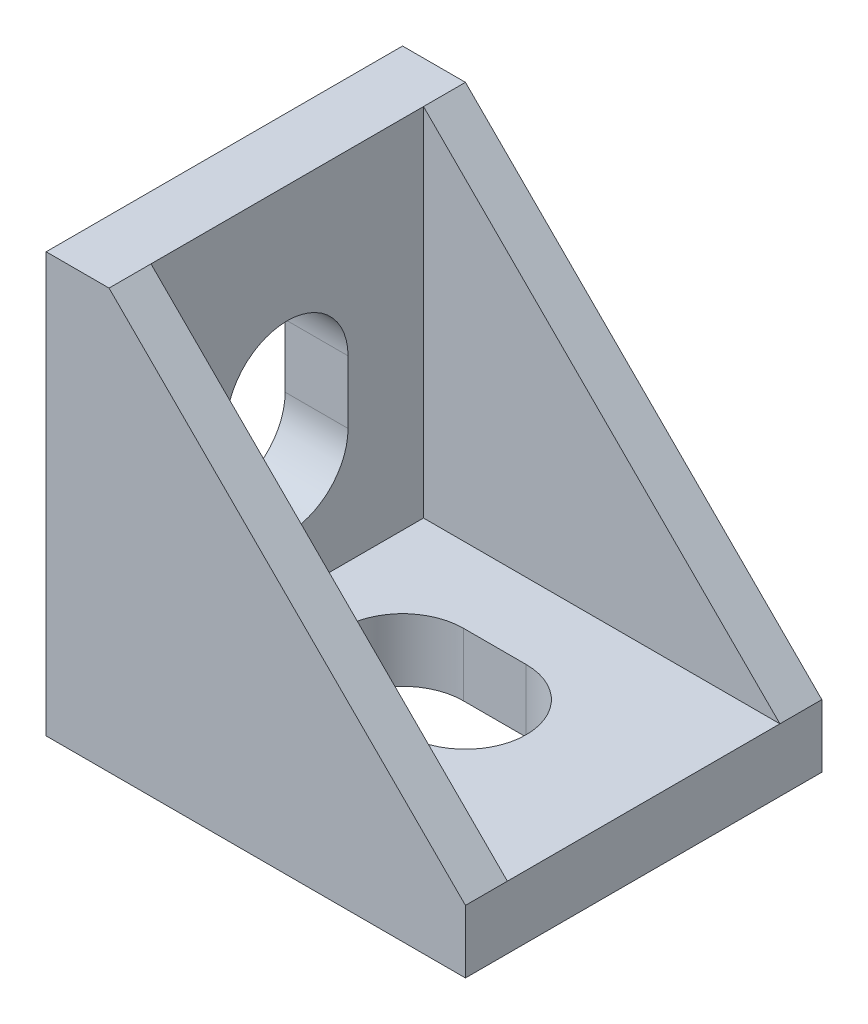
ISO-10303-21;
HEADER;
FILE_DESCRIPTION(('STEP AP214'),'2;1');
FILE_NAME('part.step','',(''),(''),'','','');
FILE_SCHEMA(('AUTOMOTIVE_DESIGN { 1 0 10303 214 1 1 1 1 }'));
ENDSEC;
DATA;
#1=APPLICATION_CONTEXT('core data for automotive mechanical design processes');
#2=APPLICATION_PROTOCOL_DEFINITION('international standard','automotive_design',2000,#1);
#3=PRODUCT_CONTEXT('',#1,'mechanical');
#4=PRODUCT('Part','Part','',(#3));
#5=PRODUCT_RELATED_PRODUCT_CATEGORY('part','',(#4));
#6=PRODUCT_DEFINITION_FORMATION('','',#4);
#7=PRODUCT_DEFINITION_CONTEXT('part definition',#1,'design');
#8=PRODUCT_DEFINITION('design','',#6,#7);
#9=PRODUCT_DEFINITION_SHAPE('','',#8);
#10=(LENGTH_UNIT() NAMED_UNIT(*) SI_UNIT(.MILLI.,.METRE.));
#11=(NAMED_UNIT(*) PLANE_ANGLE_UNIT() SI_UNIT($,.RADIAN.));
#12=(NAMED_UNIT(*) SI_UNIT($,.STERADIAN.) SOLID_ANGLE_UNIT());
#13=UNCERTAINTY_MEASURE_WITH_UNIT(LENGTH_MEASURE(1.E-05),#10,'distance_accuracy_value','');
#14=(GEOMETRIC_REPRESENTATION_CONTEXT(3) GLOBAL_UNCERTAINTY_ASSIGNED_CONTEXT((#13)) GLOBAL_UNIT_ASSIGNED_CONTEXT((#10,
#11,#12)) REPRESENTATION_CONTEXT('',''));
#15=CARTESIAN_POINT('',(0.,0.,0.));
#16=DIRECTION('',(0.,0.,1.));
#17=DIRECTION('',(1.,0.,0.));
#18=AXIS2_PLACEMENT_3D('',#15,#16,#17);
#19=CARTESIAN_POINT('',(0.,0.,-2.));
#20=DIRECTION('',(0.,0.,-1.));
#21=DIRECTION('',(0.,-1.,0.));
#22=AXIS2_PLACEMENT_3D('',#19,#20,#21);
#23=PLANE('',#22);
#24=DIRECTION('',(0.,1.,0.));
#25=VECTOR('',#24,1.);
#26=CARTESIAN_POINT('',(18.5,-0.999999999999928,-2.));
#27=LINE('',#26,#25);
#28=CARTESIAN_POINT('',(18.5,-0.999999999999928,-2.));
#29=VERTEX_POINT('',#28);
#30=CARTESIAN_POINT('',(18.5,0.,-2.));
#31=VERTEX_POINT('',#30);
#32=EDGE_CURVE('E505',#29,#31,#27,.T.);
#33=ORIENTED_EDGE('',*,*,#32,.F.);
#34=DIRECTION('',(1.,0.,0.));
#35=VECTOR('',#34,1.);
#36=CARTESIAN_POINT('',(16.65,-0.999999999999935,-2.));
#37=LINE('',#36,#35);
#38=CARTESIAN_POINT('',(16.65,-0.999999999999935,-2.));
#39=VERTEX_POINT('',#38);
#40=EDGE_CURVE('E25',#39,#29,#37,.T.);
#41=ORIENTED_EDGE('',*,*,#40,.F.);
#42=DIRECTION('',(0.,-1.,0.));
#43=VECTOR('',#42,1.);
#44=CARTESIAN_POINT('',(16.65,0.,-2.));
#45=LINE('',#44,#43);
#46=CARTESIAN_POINT('',(16.65,0.,-2.));
#47=VERTEX_POINT('',#46);
#48=EDGE_CURVE('E598',#47,#39,#45,.T.);
#49=ORIENTED_EDGE('',*,*,#48,.F.);
#50=DIRECTION('',(-1.,0.,0.));
#51=VECTOR('',#50,1.);
#52=CARTESIAN_POINT('',(18.5,0.,-2.));
#53=LINE('',#52,#51);
#54=EDGE_CURVE('E368',#31,#47,#53,.T.);
#55=ORIENTED_EDGE('',*,*,#54,.F.);
#56=EDGE_LOOP('',(#33,#41,#49,#55));
#57=FACE_BOUND('',#56,.T.);
#58=ADVANCED_FACE('F17',(#57),#23,.T.);
#59=CARTESIAN_POINT('',(0.,0.,2.));
#60=DIRECTION('',(0.,0.,-1.));
#61=DIRECTION('',(0.,-1.,0.));
#62=AXIS2_PLACEMENT_3D('',#59,#60,#61);
#63=PLANE('',#62);
#64=DIRECTION('',(0.,1.,0.));
#65=VECTOR('',#64,1.);
#66=CARTESIAN_POINT('',(18.5,-0.999999999999928,2.));
#67=LINE('',#66,#65);
#68=CARTESIAN_POINT('',(18.5,-0.999999999999928,2.));
#69=VERTEX_POINT('',#68);
#70=CARTESIAN_POINT('',(18.5,0.,2.));
#71=VERTEX_POINT('',#70);
#72=EDGE_CURVE('E508',#69,#71,#67,.T.);
#73=ORIENTED_EDGE('',*,*,#72,.T.);
#74=DIRECTION('',(-1.,0.,0.));
#75=VECTOR('',#74,1.);
#76=CARTESIAN_POINT('',(18.5,0.,2.));
#77=LINE('',#76,#75);
#78=CARTESIAN_POINT('',(16.65,0.,2.));
#79=VERTEX_POINT('',#78);
#80=EDGE_CURVE('E316',#71,#79,#77,.T.);
#81=ORIENTED_EDGE('',*,*,#80,.T.);
#82=DIRECTION('',(0.,-1.,0.));
#83=VECTOR('',#82,1.);
#84=CARTESIAN_POINT('',(16.65,0.,2.));
#85=LINE('',#84,#83);
#86=CARTESIAN_POINT('',(16.65,-0.999999999999935,2.));
#87=VERTEX_POINT('',#86);
#88=EDGE_CURVE('E454',#79,#87,#85,.T.);
#89=ORIENTED_EDGE('',*,*,#88,.T.);
#90=DIRECTION('',(1.,0.,0.));
#91=VECTOR('',#90,1.);
#92=CARTESIAN_POINT('',(16.65,-0.999999999999935,2.));
#93=LINE('',#92,#91);
#94=EDGE_CURVE('E11',#87,#69,#93,.T.);
#95=ORIENTED_EDGE('',*,*,#94,.T.);
#96=EDGE_LOOP('',(#73,#81,#89,#95));
#97=FACE_BOUND('',#96,.T.);
#98=ADVANCED_FACE('F673',(#97),#63,.F.);
#99=CARTESIAN_POINT('',(18.5,-0.999999999999928,2.));
#100=DIRECTION('',(0.,1.,0.));
#101=DIRECTION('',(1.,0.,0.));
#102=AXIS2_PLACEMENT_3D('',#99,#100,#101);
#103=PLANE('',#102);
#104=ORIENTED_EDGE('',*,*,#40,.T.);
#105=DIRECTION('',(0.,0.,-1.));
#106=VECTOR('',#105,1.);
#107=CARTESIAN_POINT('',(18.5,-0.999999999999928,2.));
#108=LINE('',#107,#106);
#109=EDGE_CURVE('E594',#69,#29,#108,.T.);
#110=ORIENTED_EDGE('',*,*,#109,.F.);
#111=ORIENTED_EDGE('',*,*,#94,.F.);
#112=DIRECTION('',(0.,0.,-1.));
#113=VECTOR('',#112,1.);
#114=CARTESIAN_POINT('',(16.65,-0.999999999999935,2.));
#115=LINE('',#114,#113);
#116=EDGE_CURVE('E617',#87,#39,#115,.T.);
#117=ORIENTED_EDGE('',*,*,#116,.T.);
#118=EDGE_LOOP('',(#104,#110,#111,#117));
#119=FACE_BOUND('',#118,.T.);
#120=ADVANCED_FACE('F661',(#119),#103,.F.);
#121=CARTESIAN_POINT('',(16.65,0.,2.));
#122=DIRECTION('',(1.,0.,0.));
#123=DIRECTION('',(0.,1.,0.));
#124=AXIS2_PLACEMENT_3D('',#121,#122,#123);
#125=PLANE('',#124);
#126=ORIENTED_EDGE('',*,*,#48,.T.);
#127=ORIENTED_EDGE('',*,*,#116,.F.);
#128=ORIENTED_EDGE('',*,*,#88,.F.);
#129=DIRECTION('',(0.,0.,-1.));
#130=VECTOR('',#129,1.);
#131=CARTESIAN_POINT('',(16.65,0.,2.));
#132=LINE('',#131,#130);
#133=EDGE_CURVE('E377',#79,#47,#132,.T.);
#134=ORIENTED_EDGE('',*,*,#133,.T.);
#135=EDGE_LOOP('',(#126,#127,#128,#134));
#136=FACE_BOUND('',#135,.T.);
#137=ADVANCED_FACE('F663',(#136),#125,.F.);
#138=CARTESIAN_POINT('',(18.5,0.,2.));
#139=DIRECTION('',(-1.,0.,0.));
#140=DIRECTION('',(0.,1.,0.));
#141=AXIS2_PLACEMENT_3D('',#138,#139,#140);
#142=PLANE('',#141);
#143=ORIENTED_EDGE('',*,*,#32,.T.);
#144=DIRECTION('',(0.,0.,-1.));
#145=VECTOR('',#144,1.);
#146=CARTESIAN_POINT('',(18.5,0.,2.));
#147=LINE('',#146,#145);
#148=EDGE_CURVE('E358',#71,#31,#147,.T.);
#149=ORIENTED_EDGE('',*,*,#148,.F.);
#150=ORIENTED_EDGE('',*,*,#72,.F.);
#151=ORIENTED_EDGE('',*,*,#109,.T.);
#152=EDGE_LOOP('',(#143,#149,#150,#151));
#153=FACE_BOUND('',#152,.T.);
#154=ADVANCED_FACE('F671',(#153),#142,.F.);
#155=CARTESIAN_POINT('',(0.,0.,-2.));
#156=DIRECTION('',(0.,0.,-1.));
#157=DIRECTION('',(0.,-1.,0.));
#158=AXIS2_PLACEMENT_3D('',#155,#156,#157);
#159=PLANE('',#158);
#160=DIRECTION('',(-1.,0.,0.));
#161=VECTOR('',#160,1.);
#162=CARTESIAN_POINT('',(3.35,0.,-2.));
#163=LINE('',#162,#161);
#164=CARTESIAN_POINT('',(3.35,0.,-2.));
#165=VERTEX_POINT('',#164);
#166=CARTESIAN_POINT('',(1.5,0.,-2.));
#167=VERTEX_POINT('',#166);
#168=EDGE_CURVE('E352',#165,#167,#163,.T.);
#169=ORIENTED_EDGE('',*,*,#168,.F.);
#170=DIRECTION('',(0.,1.,0.));
#171=VECTOR('',#170,1.);
#172=CARTESIAN_POINT('',(3.35,-0.999999999999984,-2.));
#173=LINE('',#172,#171);
#174=CARTESIAN_POINT('',(3.35,-0.999999999999984,-2.));
#175=VERTEX_POINT('',#174);
#176=EDGE_CURVE('E396',#175,#165,#173,.T.);
#177=ORIENTED_EDGE('',*,*,#176,.F.);
#178=DIRECTION('',(1.,0.,0.));
#179=VECTOR('',#178,1.);
#180=CARTESIAN_POINT('',(1.5,-1.,-2.));
#181=LINE('',#180,#179);
#182=CARTESIAN_POINT('',(1.5,-1.,-2.));
#183=VERTEX_POINT('',#182);
#184=EDGE_CURVE('E401',#183,#175,#181,.T.);
#185=ORIENTED_EDGE('',*,*,#184,.F.);
#186=DIRECTION('',(0.,-1.,0.));
#187=VECTOR('',#186,1.);
#188=CARTESIAN_POINT('',(1.5,0.,-2.));
#189=LINE('',#188,#187);
#190=EDGE_CURVE('E603',#167,#183,#189,.T.);
#191=ORIENTED_EDGE('',*,*,#190,.F.);
#192=EDGE_LOOP('',(#169,#177,#185,#191));
#193=FACE_BOUND('',#192,.T.);
#194=ADVANCED_FACE('F686',(#193),#159,.T.);
#195=CARTESIAN_POINT('',(0.,0.,2.));
#196=DIRECTION('',(0.,0.,-1.));
#197=DIRECTION('',(0.,-1.,0.));
#198=AXIS2_PLACEMENT_3D('',#195,#196,#197);
#199=PLANE('',#198);
#200=DIRECTION('',(-1.,0.,0.));
#201=VECTOR('',#200,1.);
#202=CARTESIAN_POINT('',(3.35,0.,2.));
#203=LINE('',#202,#201);
#204=CARTESIAN_POINT('',(3.35,0.,2.));
#205=VERTEX_POINT('',#204);
#206=CARTESIAN_POINT('',(1.5,0.,2.));
#207=VERTEX_POINT('',#206);
#208=EDGE_CURVE('E378',#205,#207,#203,.T.);
#209=ORIENTED_EDGE('',*,*,#208,.T.);
#210=DIRECTION('',(0.,-1.,0.));
#211=VECTOR('',#210,1.);
#212=CARTESIAN_POINT('',(1.5,0.,2.));
#213=LINE('',#212,#211);
#214=CARTESIAN_POINT('',(1.5,-1.,2.));
#215=VERTEX_POINT('',#214);
#216=EDGE_CURVE('E405',#207,#215,#213,.T.);
#217=ORIENTED_EDGE('',*,*,#216,.T.);
#218=DIRECTION('',(1.,0.,0.));
#219=VECTOR('',#218,1.);
#220=CARTESIAN_POINT('',(1.5,-1.,2.));
#221=LINE('',#220,#219);
#222=CARTESIAN_POINT('',(3.35,-0.999999999999984,2.));
#223=VERTEX_POINT('',#222);
#224=EDGE_CURVE('E392',#215,#223,#221,.T.);
#225=ORIENTED_EDGE('',*,*,#224,.T.);
#226=DIRECTION('',(0.,1.,0.));
#227=VECTOR('',#226,1.);
#228=CARTESIAN_POINT('',(3.35,-0.999999999999984,2.));
#229=LINE('',#228,#227);
#230=EDGE_CURVE('E509',#223,#205,#229,.T.);
#231=ORIENTED_EDGE('',*,*,#230,.T.);
#232=EDGE_LOOP('',(#209,#217,#225,#231));
#233=FACE_BOUND('',#232,.T.);
#234=ADVANCED_FACE('F689',(#233),#199,.F.);
#235=CARTESIAN_POINT('',(3.35,0.,2.));
#236=DIRECTION('',(-1.,0.,0.));
#237=DIRECTION('',(0.,1.,0.));
#238=AXIS2_PLACEMENT_3D('',#235,#236,#237);
#239=PLANE('',#238);
#240=ORIENTED_EDGE('',*,*,#176,.T.);
#241=DIRECTION('',(0.,0.,-1.));
#242=VECTOR('',#241,1.);
#243=CARTESIAN_POINT('',(3.35,0.,2.));
#244=LINE('',#243,#242);
#245=EDGE_CURVE('E382',#205,#165,#244,.T.);
#246=ORIENTED_EDGE('',*,*,#245,.F.);
#247=ORIENTED_EDGE('',*,*,#230,.F.);
#248=DIRECTION('',(0.,0.,-1.));
#249=VECTOR('',#248,1.);
#250=CARTESIAN_POINT('',(3.35,-0.999999999999984,2.));
#251=LINE('',#250,#249);
#252=EDGE_CURVE('E397',#223,#175,#251,.T.);
#253=ORIENTED_EDGE('',*,*,#252,.T.);
#254=EDGE_LOOP('',(#240,#246,#247,#253));
#255=FACE_BOUND('',#254,.T.);
#256=ADVANCED_FACE('F693',(#255),#239,.F.);
#257=CARTESIAN_POINT('',(1.5,-1.,2.));
#258=DIRECTION('',(0.,1.,0.));
#259=DIRECTION('',(1.,0.,0.));
#260=AXIS2_PLACEMENT_3D('',#257,#258,#259);
#261=PLANE('',#260);
#262=ORIENTED_EDGE('',*,*,#184,.T.);
#263=ORIENTED_EDGE('',*,*,#252,.F.);
#264=ORIENTED_EDGE('',*,*,#224,.F.);
#265=DIRECTION('',(0.,0.,-1.));
#266=VECTOR('',#265,1.);
#267=CARTESIAN_POINT('',(1.5,-1.,2.));
#268=LINE('',#267,#266);
#269=EDGE_CURVE('E590',#215,#183,#268,.T.);
#270=ORIENTED_EDGE('',*,*,#269,.T.);
#271=EDGE_LOOP('',(#262,#263,#264,#270));
#272=FACE_BOUND('',#271,.T.);
#273=ADVANCED_FACE('F695',(#272),#261,.F.);
#274=CARTESIAN_POINT('',(1.5,0.,2.));
#275=DIRECTION('',(1.,0.,0.));
#276=DIRECTION('',(0.,-1.,0.));
#277=AXIS2_PLACEMENT_3D('',#274,#275,#276);
#278=PLANE('',#277);
#279=ORIENTED_EDGE('',*,*,#190,.T.);
#280=ORIENTED_EDGE('',*,*,#269,.F.);
#281=ORIENTED_EDGE('',*,*,#216,.F.);
#282=DIRECTION('',(0.,0.,-1.));
#283=VECTOR('',#282,1.);
#284=CARTESIAN_POINT('',(1.5,0.,2.));
#285=LINE('',#284,#283);
#286=EDGE_CURVE('E347',#207,#167,#285,.T.);
#287=ORIENTED_EDGE('',*,*,#286,.T.);
#288=EDGE_LOOP('',(#279,#280,#281,#287));
#289=FACE_BOUND('',#288,.T.);
#290=ADVANCED_FACE('F698',(#289),#278,.F.);
#291=CARTESIAN_POINT('',(0.,0.,-2.));
#292=DIRECTION('',(0.,0.,-1.));
#293=DIRECTION('',(0.,-1.,0.));
#294=AXIS2_PLACEMENT_3D('',#291,#292,#293);
#295=PLANE('',#294);
#296=DIRECTION('',(1.,0.,0.));
#297=VECTOR('',#296,1.);
#298=CARTESIAN_POINT('',(-1.,1.5,-2.));
#299=LINE('',#298,#297);
#300=CARTESIAN_POINT('',(-1.,1.5,-2.));
#301=VERTEX_POINT('',#300);
#302=CARTESIAN_POINT('',(0.,1.5,-2.));
#303=VERTEX_POINT('',#302);
#304=EDGE_CURVE('E346',#301,#303,#299,.T.);
#305=ORIENTED_EDGE('',*,*,#304,.F.);
#306=DIRECTION('',(0.,-1.,0.));
#307=VECTOR('',#306,1.);
#308=CARTESIAN_POINT('',(-1.,3.35,-2.));
#309=LINE('',#308,#307);
#310=CARTESIAN_POINT('',(-1.,3.35,-2.));
#311=VERTEX_POINT('',#310);
#312=EDGE_CURVE('E635',#311,#301,#309,.T.);
#313=ORIENTED_EDGE('',*,*,#312,.F.);
#314=DIRECTION('',(-1.,0.,0.));
#315=VECTOR('',#314,1.);
#316=CARTESIAN_POINT('',(0.,3.35,-2.));
#317=LINE('',#316,#315);
#318=CARTESIAN_POINT('',(0.,3.35,-2.));
#319=VERTEX_POINT('',#318);
#320=EDGE_CURVE('E464',#319,#311,#317,.T.);
#321=ORIENTED_EDGE('',*,*,#320,.F.);
#322=DIRECTION('',(0.,1.,0.));
#323=VECTOR('',#322,1.);
#324=CARTESIAN_POINT('',(0.,1.5,-2.));
#325=LINE('',#324,#323);
#326=EDGE_CURVE('E433',#303,#319,#325,.T.);
#327=ORIENTED_EDGE('',*,*,#326,.F.);
#328=EDGE_LOOP('',(#305,#313,#321,#327));
#329=FACE_BOUND('',#328,.T.);
#330=ADVANCED_FACE('F700',(#329),#295,.T.);
#331=CARTESIAN_POINT('',(0.,0.,2.));
#332=DIRECTION('',(0.,0.,-1.));
#333=DIRECTION('',(0.,-1.,0.));
#334=AXIS2_PLACEMENT_3D('',#331,#332,#333);
#335=PLANE('',#334);
#336=DIRECTION('',(1.,0.,0.));
#337=VECTOR('',#336,1.);
#338=CARTESIAN_POINT('',(-1.,1.5,2.));
#339=LINE('',#338,#337);
#340=CARTESIAN_POINT('',(-1.,1.5,2.));
#341=VERTEX_POINT('',#340);
#342=CARTESIAN_POINT('',(0.,1.5,2.));
#343=VERTEX_POINT('',#342);
#344=EDGE_CURVE('E342',#341,#343,#339,.T.);
#345=ORIENTED_EDGE('',*,*,#344,.T.);
#346=DIRECTION('',(0.,1.,0.));
#347=VECTOR('',#346,1.);
#348=CARTESIAN_POINT('',(0.,1.5,2.));
#349=LINE('',#348,#347);
#350=CARTESIAN_POINT('',(0.,3.35,2.));
#351=VERTEX_POINT('',#350);
#352=EDGE_CURVE('E434',#343,#351,#349,.T.);
#353=ORIENTED_EDGE('',*,*,#352,.T.);
#354=DIRECTION('',(-1.,0.,0.));
#355=VECTOR('',#354,1.);
#356=CARTESIAN_POINT('',(0.,3.35,2.));
#357=LINE('',#356,#355);
#358=CARTESIAN_POINT('',(-1.,3.35,2.));
#359=VERTEX_POINT('',#358);
#360=EDGE_CURVE('E638',#351,#359,#357,.T.);
#361=ORIENTED_EDGE('',*,*,#360,.T.);
#362=DIRECTION('',(0.,-1.,0.));
#363=VECTOR('',#362,1.);
#364=CARTESIAN_POINT('',(-1.,3.35,2.));
#365=LINE('',#364,#363);
#366=EDGE_CURVE('E607',#359,#341,#365,.T.);
#367=ORIENTED_EDGE('',*,*,#366,.T.);
#368=EDGE_LOOP('',(#345,#353,#361,#367));
#369=FACE_BOUND('',#368,.T.);
#370=ADVANCED_FACE('F703',(#369),#335,.F.);
#371=CARTESIAN_POINT('',(-1.,1.5,2.));
#372=DIRECTION('',(1.,0.,0.));
#373=DIRECTION('',(0.,1.,0.));
#374=AXIS2_PLACEMENT_3D('',#371,#372,#373);
#375=PLANE('',#374);
#376=ORIENTED_EDGE('',*,*,#312,.T.);
#377=DIRECTION('',(0.,0.,-1.));
#378=VECTOR('',#377,1.);
#379=CARTESIAN_POINT('',(-1.,1.5,2.));
#380=LINE('',#379,#378);
#381=EDGE_CURVE('E345',#341,#301,#380,.T.);
#382=ORIENTED_EDGE('',*,*,#381,.F.);
#383=ORIENTED_EDGE('',*,*,#366,.F.);
#384=DIRECTION('',(0.,0.,-1.));
#385=VECTOR('',#384,1.);
#386=CARTESIAN_POINT('',(-1.,3.35,2.));
#387=LINE('',#386,#385);
#388=EDGE_CURVE('E634',#359,#311,#387,.T.);
#389=ORIENTED_EDGE('',*,*,#388,.T.);
#390=EDGE_LOOP('',(#376,#382,#383,#389));
#391=FACE_BOUND('',#390,.T.);
#392=ADVANCED_FACE('F707',(#391),#375,.F.);
#393=CARTESIAN_POINT('',(0.,3.35,2.));
#394=DIRECTION('',(0.,-1.,0.));
#395=DIRECTION('',(0.,0.,-1.));
#396=AXIS2_PLACEMENT_3D('',#393,#394,#395);
#397=PLANE('',#396);
#398=ORIENTED_EDGE('',*,*,#320,.T.);
#399=ORIENTED_EDGE('',*,*,#388,.F.);
#400=ORIENTED_EDGE('',*,*,#360,.F.);
#401=DIRECTION('',(0.,0.,-1.));
#402=VECTOR('',#401,1.);
#403=CARTESIAN_POINT('',(0.,3.35,2.));
#404=LINE('',#403,#402);
#405=EDGE_CURVE('E471',#351,#319,#404,.T.);
#406=ORIENTED_EDGE('',*,*,#405,.T.);
#407=EDGE_LOOP('',(#398,#399,#400,#406));
#408=FACE_BOUND('',#407,.T.);
#409=ADVANCED_FACE('F711',(#408),#397,.F.);
#410=CARTESIAN_POINT('',(0.,1.5,2.));
#411=DIRECTION('',(0.,1.,0.));
#412=DIRECTION('',(1.,0.,0.));
#413=AXIS2_PLACEMENT_3D('',#410,#411,#412);
#414=PLANE('',#413);
#415=ORIENTED_EDGE('',*,*,#304,.T.);
#416=DIRECTION('',(0.,0.,-1.));
#417=VECTOR('',#416,1.);
#418=CARTESIAN_POINT('',(0.,1.5,2.));
#419=LINE('',#418,#417);
#420=EDGE_CURVE('E429',#343,#303,#419,.T.);
#421=ORIENTED_EDGE('',*,*,#420,.F.);
#422=ORIENTED_EDGE('',*,*,#344,.F.);
#423=ORIENTED_EDGE('',*,*,#381,.T.);
#424=EDGE_LOOP('',(#415,#421,#422,#423));
#425=FACE_BOUND('',#424,.T.);
#426=ADVANCED_FACE('F715',(#425),#414,.F.);
#427=CARTESIAN_POINT('',(0.,0.,-2.));
#428=DIRECTION('',(0.,0.,-1.));
#429=DIRECTION('',(0.,-1.,0.));
#430=AXIS2_PLACEMENT_3D('',#427,#428,#429);
#431=PLANE('',#430);
#432=DIRECTION('',(0.,1.,0.));
#433=VECTOR('',#432,1.);
#434=CARTESIAN_POINT('',(0.,16.65,-2.));
#435=LINE('',#434,#433);
#436=CARTESIAN_POINT('',(0.,16.65,-2.));
#437=VERTEX_POINT('',#436);
#438=CARTESIAN_POINT('',(0.,18.5,-2.));
#439=VERTEX_POINT('',#438);
#440=EDGE_CURVE('E443',#437,#439,#435,.T.);
#441=ORIENTED_EDGE('',*,*,#440,.F.);
#442=DIRECTION('',(1.,0.,0.));
#443=VECTOR('',#442,1.);
#444=CARTESIAN_POINT('',(-1.,16.65,-2.));
#445=LINE('',#444,#443);
#446=CARTESIAN_POINT('',(-1.,16.65,-2.));
#447=VERTEX_POINT('',#446);
#448=EDGE_CURVE('E415',#447,#437,#445,.T.);
#449=ORIENTED_EDGE('',*,*,#448,.F.);
#450=DIRECTION('',(0.,-1.,0.));
#451=VECTOR('',#450,1.);
#452=CARTESIAN_POINT('',(-1.,18.5,-2.));
#453=LINE('',#452,#451);
#454=CARTESIAN_POINT('',(-1.,18.5,-2.));
#455=VERTEX_POINT('',#454);
#456=EDGE_CURVE('E476',#455,#447,#453,.T.);
#457=ORIENTED_EDGE('',*,*,#456,.F.);
#458=DIRECTION('',(-1.,0.,0.));
#459=VECTOR('',#458,1.);
#460=CARTESIAN_POINT('',(0.,18.5,-2.));
#461=LINE('',#460,#459);
#462=EDGE_CURVE('E386',#439,#455,#461,.T.);
#463=ORIENTED_EDGE('',*,*,#462,.F.);
#464=EDGE_LOOP('',(#441,#449,#457,#463));
#465=FACE_BOUND('',#464,.T.);
#466=ADVANCED_FACE('F719',(#465),#431,.T.);
#467=CARTESIAN_POINT('',(0.,0.,2.));
#468=DIRECTION('',(0.,0.,-1.));
#469=DIRECTION('',(0.,-1.,0.));
#470=AXIS2_PLACEMENT_3D('',#467,#468,#469);
#471=PLANE('',#470);
#472=DIRECTION('',(0.,1.,0.));
#473=VECTOR('',#472,1.);
#474=CARTESIAN_POINT('',(0.,16.65,2.));
#475=LINE('',#474,#473);
#476=CARTESIAN_POINT('',(0.,16.65,2.));
#477=VERTEX_POINT('',#476);
#478=CARTESIAN_POINT('',(0.,18.5,2.));
#479=VERTEX_POINT('',#478);
#480=EDGE_CURVE('E450',#477,#479,#475,.T.);
#481=ORIENTED_EDGE('',*,*,#480,.T.);
#482=DIRECTION('',(-1.,0.,0.));
#483=VECTOR('',#482,1.);
#484=CARTESIAN_POINT('',(0.,18.5,2.));
#485=LINE('',#484,#483);
#486=CARTESIAN_POINT('',(-1.,18.5,2.));
#487=VERTEX_POINT('',#486);
#488=EDGE_CURVE('E472',#479,#487,#485,.T.);
#489=ORIENTED_EDGE('',*,*,#488,.T.);
#490=DIRECTION('',(0.,-1.,0.));
#491=VECTOR('',#490,1.);
#492=CARTESIAN_POINT('',(-1.,18.5,2.));
#493=LINE('',#492,#491);
#494=CARTESIAN_POINT('',(-1.,16.65,2.));
#495=VERTEX_POINT('',#494);
#496=EDGE_CURVE('E332',#487,#495,#493,.T.);
#497=ORIENTED_EDGE('',*,*,#496,.T.);
#498=DIRECTION('',(1.,0.,0.));
#499=VECTOR('',#498,1.);
#500=CARTESIAN_POINT('',(-1.,16.65,2.));
#501=LINE('',#500,#499);
#502=EDGE_CURVE('E412',#495,#477,#501,.T.);
#503=ORIENTED_EDGE('',*,*,#502,.T.);
#504=EDGE_LOOP('',(#481,#489,#497,#503));
#505=FACE_BOUND('',#504,.T.);
#506=ADVANCED_FACE('F723',(#505),#471,.F.);
#507=CARTESIAN_POINT('',(0.,16.65,2.));
#508=DIRECTION('',(0.,1.,0.));
#509=DIRECTION('',(1.,0.,0.));
#510=AXIS2_PLACEMENT_3D('',#507,#508,#509);
#511=PLANE('',#510);
#512=ORIENTED_EDGE('',*,*,#448,.T.);
#513=DIRECTION('',(0.,0.,-1.));
#514=VECTOR('',#513,1.);
#515=CARTESIAN_POINT('',(0.,16.65,2.));
#516=LINE('',#515,#514);
#517=EDGE_CURVE('E447',#477,#437,#516,.T.);
#518=ORIENTED_EDGE('',*,*,#517,.F.);
#519=ORIENTED_EDGE('',*,*,#502,.F.);
#520=DIRECTION('',(0.,0.,-1.));
#521=VECTOR('',#520,1.);
#522=CARTESIAN_POINT('',(-1.,16.65,2.));
#523=LINE('',#522,#521);
#524=EDGE_CURVE('E627',#495,#447,#523,.T.);
#525=ORIENTED_EDGE('',*,*,#524,.T.);
#526=EDGE_LOOP('',(#512,#518,#519,#525));
#527=FACE_BOUND('',#526,.T.);
#528=ADVANCED_FACE('F727',(#527),#511,.F.);
#529=CARTESIAN_POINT('',(-1.,18.5,2.));
#530=DIRECTION('',(1.,0.,0.));
#531=DIRECTION('',(0.,1.,0.));
#532=AXIS2_PLACEMENT_3D('',#529,#530,#531);
#533=PLANE('',#532);
#534=ORIENTED_EDGE('',*,*,#456,.T.);
#535=ORIENTED_EDGE('',*,*,#524,.F.);
#536=ORIENTED_EDGE('',*,*,#496,.F.);
#537=DIRECTION('',(0.,0.,-1.));
#538=VECTOR('',#537,1.);
#539=CARTESIAN_POINT('',(-1.,18.5,2.));
#540=LINE('',#539,#538);
#541=EDGE_CURVE('E477',#487,#455,#540,.T.);
#542=ORIENTED_EDGE('',*,*,#541,.T.);
#543=EDGE_LOOP('',(#534,#535,#536,#542));
#544=FACE_BOUND('',#543,.T.);
#545=ADVANCED_FACE('F731',(#544),#533,.F.);
#546=CARTESIAN_POINT('',(0.,18.5,2.));
#547=DIRECTION('',(0.,-1.,0.));
#548=DIRECTION('',(-1.,0.,0.));
#549=AXIS2_PLACEMENT_3D('',#546,#547,#548);
#550=PLANE('',#549);
#551=ORIENTED_EDGE('',*,*,#462,.T.);
#552=ORIENTED_EDGE('',*,*,#541,.F.);
#553=ORIENTED_EDGE('',*,*,#488,.F.);
#554=DIRECTION('',(0.,0.,-1.));
#555=VECTOR('',#554,1.);
#556=CARTESIAN_POINT('',(0.,18.5,2.));
#557=LINE('',#556,#555);
#558=EDGE_CURVE('E438',#479,#439,#557,.T.);
#559=ORIENTED_EDGE('',*,*,#558,.T.);
#560=EDGE_LOOP('',(#551,#552,#553,#559));
#561=FACE_BOUND('',#560,.T.);
#562=ADVANCED_FACE('F735',(#561),#550,.F.);
#563=CARTESIAN_POINT('',(11.5,0.,-2.9));
#564=DIRECTION('',(0.,0.,-1.));
#565=DIRECTION('',(-1.,0.,0.));
#566=AXIS2_PLACEMENT_3D('',#563,#564,#565);
#567=PLANE('',#566);
#568=DIRECTION('',(-1.,0.,0.));
#569=VECTOR('',#568,1.);
#570=CARTESIAN_POINT('',(11.5,3.,-2.9));
#571=LINE('',#570,#569);
#572=CARTESIAN_POINT('',(11.5,3.,-2.9));
#573=VERTEX_POINT('',#572);
#574=CARTESIAN_POINT('',(8.5,3.,-2.9));
#575=VERTEX_POINT('',#574);
#576=EDGE_CURVE('E428',#573,#575,#571,.T.);
#577=ORIENTED_EDGE('',*,*,#576,.T.);
#578=DIRECTION('',(0.,1.,0.));
#579=VECTOR('',#578,1.);
#580=CARTESIAN_POINT('',(8.5,0.,-2.9));
#581=LINE('',#580,#579);
#582=CARTESIAN_POINT('',(8.5,0.,-2.9));
#583=VERTEX_POINT('',#582);
#584=EDGE_CURVE('E383',#583,#575,#581,.T.);
#585=ORIENTED_EDGE('',*,*,#584,.F.);
#586=DIRECTION('',(-1.,0.,0.));
#587=VECTOR('',#586,1.);
#588=CARTESIAN_POINT('',(11.5,0.,-2.9));
#589=LINE('',#588,#587);
#590=CARTESIAN_POINT('',(11.5,0.,-2.9));
#591=VERTEX_POINT('',#590);
#592=EDGE_CURVE('E423',#591,#583,#589,.T.);
#593=ORIENTED_EDGE('',*,*,#592,.F.);
#594=DIRECTION('',(0.,1.,0.));
#595=VECTOR('',#594,1.);
#596=CARTESIAN_POINT('',(11.5,0.,-2.9));
#597=LINE('',#596,#595);
#598=EDGE_CURVE('E335',#591,#573,#597,.T.);
#599=ORIENTED_EDGE('',*,*,#598,.T.);
#600=EDGE_LOOP('',(#577,#585,#593,#599));
#601=FACE_BOUND('',#600,.T.);
#602=ADVANCED_FACE('F739',(#601),#567,.F.);
#603=CARTESIAN_POINT('',(8.5,0.,0.));
#604=DIRECTION('',(0.,1.,0.));
#605=DIRECTION('',(-1.,0.,0.));
#606=AXIS2_PLACEMENT_3D('',#603,#604,#605);
#607=CYLINDRICAL_SURFACE('',#606,2.9);
#608=CARTESIAN_POINT('',(8.5,3.,0.));
#609=DIRECTION('',(0.,1.,0.));
#610=DIRECTION('',(-1.,0.,0.));
#611=AXIS2_PLACEMENT_3D('',#608,#609,#610);
#612=CIRCLE('',#611,2.9);
#613=CARTESIAN_POINT('',(8.5,3.,2.9));
#614=VERTEX_POINT('',#613);
#615=EDGE_CURVE('E424',#575,#614,#612,.T.);
#616=ORIENTED_EDGE('',*,*,#615,.T.);
#617=DIRECTION('',(0.,1.,0.));
#618=VECTOR('',#617,1.);
#619=CARTESIAN_POINT('',(8.5,0.,2.9));
#620=LINE('',#619,#618);
#621=CARTESIAN_POINT('',(8.5,0.,2.9));
#622=VERTEX_POINT('',#621);
#623=EDGE_CURVE('E387',#622,#614,#620,.T.);
#624=ORIENTED_EDGE('',*,*,#623,.F.);
#625=CARTESIAN_POINT('',(8.5,0.,0.));
#626=DIRECTION('',(0.,1.,0.));
#627=DIRECTION('',(-1.,0.,0.));
#628=AXIS2_PLACEMENT_3D('',#625,#626,#627);
#629=CIRCLE('',#628,2.9);
#630=EDGE_CURVE('E306',#583,#622,#629,.T.);
#631=ORIENTED_EDGE('',*,*,#630,.F.);
#632=ORIENTED_EDGE('',*,*,#584,.T.);
#633=EDGE_LOOP('',(#616,#624,#631,#632));
#634=FACE_BOUND('',#633,.T.);
#635=ADVANCED_FACE('F743',(#634),#607,.F.);
#636=CARTESIAN_POINT('',(11.5,0.,2.9));
#637=DIRECTION('',(0.,0.,1.));
#638=DIRECTION('',(1.,0.,0.));
#639=AXIS2_PLACEMENT_3D('',#636,#637,#638);
#640=PLANE('',#639);
#641=DIRECTION('',(1.,0.,0.));
#642=VECTOR('',#641,1.);
#643=CARTESIAN_POINT('',(8.5,3.,2.9));
#644=LINE('',#643,#642);
#645=CARTESIAN_POINT('',(11.5,3.,2.9));
#646=VERTEX_POINT('',#645);
#647=EDGE_CURVE('E363',#614,#646,#644,.T.);
#648=ORIENTED_EDGE('',*,*,#647,.T.);
#649=DIRECTION('',(0.,1.,0.));
#650=VECTOR('',#649,1.);
#651=CARTESIAN_POINT('',(11.5,0.,2.9));
#652=LINE('',#651,#650);
#653=CARTESIAN_POINT('',(11.5,0.,2.9));
#654=VERTEX_POINT('',#653);
#655=EDGE_CURVE('E483',#654,#646,#652,.T.);
#656=ORIENTED_EDGE('',*,*,#655,.F.);
#657=DIRECTION('',(1.,0.,0.));
#658=VECTOR('',#657,1.);
#659=CARTESIAN_POINT('',(8.5,0.,2.9));
#660=LINE('',#659,#658);
#661=EDGE_CURVE('E351',#622,#654,#660,.T.);
#662=ORIENTED_EDGE('',*,*,#661,.F.);
#663=ORIENTED_EDGE('',*,*,#623,.T.);
#664=EDGE_LOOP('',(#648,#656,#662,#663));
#665=FACE_BOUND('',#664,.T.);
#666=ADVANCED_FACE('F747',(#665),#640,.F.);
#667=CARTESIAN_POINT('',(11.5,0.,0.));
#668=DIRECTION('',(0.,1.,0.));
#669=DIRECTION('',(1.,0.,0.));
#670=AXIS2_PLACEMENT_3D('',#667,#668,#669);
#671=CYLINDRICAL_SURFACE('',#670,2.9);
#672=CARTESIAN_POINT('',(11.5,3.,0.));
#673=DIRECTION('',(0.,1.,0.));
#674=DIRECTION('',(-1.,0.,0.));
#675=AXIS2_PLACEMENT_3D('',#672,#673,#674);
#676=CIRCLE('',#675,2.9);
#677=EDGE_CURVE('E359',#646,#573,#676,.T.);
#678=ORIENTED_EDGE('',*,*,#677,.T.);
#679=ORIENTED_EDGE('',*,*,#598,.F.);
#680=CARTESIAN_POINT('',(11.5,0.,0.));
#681=DIRECTION('',(0.,1.,0.));
#682=DIRECTION('',(-1.,0.,0.));
#683=AXIS2_PLACEMENT_3D('',#680,#681,#682);
#684=CIRCLE('',#683,2.9);
#685=EDGE_CURVE('E391',#654,#591,#684,.T.);
#686=ORIENTED_EDGE('',*,*,#685,.F.);
#687=ORIENTED_EDGE('',*,*,#655,.T.);
#688=EDGE_LOOP('',(#678,#679,#686,#687));
#689=FACE_BOUND('',#688,.T.);
#690=ADVANCED_FACE('F751',(#689),#671,.F.);
#691=CARTESIAN_POINT('',(-0.00100000000002832,8.5,-2.9));
#692=DIRECTION('',(0.,0.,-1.));
#693=DIRECTION('',(-1.,0.,0.));
#694=AXIS2_PLACEMENT_3D('',#691,#692,#693);
#695=PLANE('',#694);
#696=DIRECTION('',(0.,-1.,0.));
#697=VECTOR('',#696,1.);
#698=CARTESIAN_POINT('',(0.,11.5,-2.9));
#699=LINE('',#698,#697);
#700=CARTESIAN_POINT('',(0.,11.5,-2.9));
#701=VERTEX_POINT('',#700);
#702=CARTESIAN_POINT('',(0.,8.5,-2.9));
#703=VERTEX_POINT('',#702);
#704=EDGE_CURVE('E500',#701,#703,#699,.T.);
#705=ORIENTED_EDGE('',*,*,#704,.T.);
#706=DIRECTION('',(1.,0.,0.));
#707=VECTOR('',#706,1.);
#708=CARTESIAN_POINT('',(0.,8.5,-2.9));
#709=LINE('',#708,#707);
#710=CARTESIAN_POINT('',(3.,8.5,-2.9));
#711=VERTEX_POINT('',#710);
#712=EDGE_CURVE('E416',#703,#711,#709,.T.);
#713=ORIENTED_EDGE('',*,*,#712,.T.);
#714=DIRECTION('',(0.,1.,0.));
#715=VECTOR('',#714,1.);
#716=CARTESIAN_POINT('',(3.,8.5,-2.9));
#717=LINE('',#716,#715);
#718=CARTESIAN_POINT('',(3.,11.5,-2.9));
#719=VERTEX_POINT('',#718);
#720=EDGE_CURVE('E522',#711,#719,#717,.T.);
#721=ORIENTED_EDGE('',*,*,#720,.T.);
#722=DIRECTION('',(1.,0.,0.));
#723=VECTOR('',#722,1.);
#724=CARTESIAN_POINT('',(0.,11.5,-2.9));
#725=LINE('',#724,#723);
#726=EDGE_CURVE('E333',#701,#719,#725,.T.);
#727=ORIENTED_EDGE('',*,*,#726,.F.);
#728=EDGE_LOOP('',(#705,#713,#721,#727));
#729=FACE_BOUND('',#728,.T.);
#730=ADVANCED_FACE('F755',(#729),#695,.F.);
#731=CARTESIAN_POINT('',(-0.00100000000002095,11.5,0.));
#732=DIRECTION('',(1.,0.,0.));
#733=DIRECTION('',(0.,1.,0.));
#734=AXIS2_PLACEMENT_3D('',#731,#732,#733);
#735=CYLINDRICAL_SURFACE('',#734,2.9);
#736=CARTESIAN_POINT('',(0.,11.5,0.));
#737=DIRECTION('',(-1.,0.,0.));
#738=DIRECTION('',(0.,1.,0.));
#739=AXIS2_PLACEMENT_3D('',#736,#737,#738);
#740=CIRCLE('',#739,2.9);
#741=CARTESIAN_POINT('',(0.,11.5,2.9));
#742=VERTEX_POINT('',#741);
#743=EDGE_CURVE('E504',#742,#701,#740,.T.);
#744=ORIENTED_EDGE('',*,*,#743,.T.);
#745=ORIENTED_EDGE('',*,*,#726,.T.);
#746=CARTESIAN_POINT('',(3.,11.5,0.));
#747=DIRECTION('',(1.,0.,0.));
#748=DIRECTION('',(0.,1.,0.));
#749=AXIS2_PLACEMENT_3D('',#746,#747,#748);
#750=CIRCLE('',#749,2.9);
#751=CARTESIAN_POINT('',(3.,11.5,2.9));
#752=VERTEX_POINT('',#751);
#753=EDGE_CURVE('E364',#719,#752,#750,.T.);
#754=ORIENTED_EDGE('',*,*,#753,.T.);
#755=DIRECTION('',(1.,0.,0.));
#756=VECTOR('',#755,1.);
#757=CARTESIAN_POINT('',(0.,11.5,2.9));
#758=LINE('',#757,#756);
#759=EDGE_CURVE('E336',#742,#752,#758,.T.);
#760=ORIENTED_EDGE('',*,*,#759,.F.);
#761=EDGE_LOOP('',(#744,#745,#754,#760));
#762=FACE_BOUND('',#761,.T.);
#763=ADVANCED_FACE('F762',(#762),#735,.F.);
#764=CARTESIAN_POINT('',(-0.00100000000002745,8.5,2.9));
#765=DIRECTION('',(0.,0.,1.));
#766=DIRECTION('',(0.,-1.,0.));
#767=AXIS2_PLACEMENT_3D('',#764,#765,#766);
#768=PLANE('',#767);
#769=DIRECTION('',(0.,1.,0.));
#770=VECTOR('',#769,1.);
#771=CARTESIAN_POINT('',(0.,8.5,2.9));
#772=LINE('',#771,#770);
#773=CARTESIAN_POINT('',(0.,8.5,2.9));
#774=VERTEX_POINT('',#773);
#775=EDGE_CURVE('E442',#774,#742,#772,.T.);
#776=ORIENTED_EDGE('',*,*,#775,.T.);
#777=ORIENTED_EDGE('',*,*,#759,.T.);
#778=DIRECTION('',(0.,-1.,0.));
#779=VECTOR('',#778,1.);
#780=CARTESIAN_POINT('',(3.,11.5,2.9));
#781=LINE('',#780,#779);
#782=CARTESIAN_POINT('',(3.,8.5,2.9));
#783=VERTEX_POINT('',#782);
#784=EDGE_CURVE('E580',#752,#783,#781,.T.);
#785=ORIENTED_EDGE('',*,*,#784,.T.);
#786=DIRECTION('',(1.,0.,0.));
#787=VECTOR('',#786,1.);
#788=CARTESIAN_POINT('',(0.,8.5,2.9));
#789=LINE('',#788,#787);
#790=EDGE_CURVE('E419',#774,#783,#789,.T.);
#791=ORIENTED_EDGE('',*,*,#790,.F.);
#792=EDGE_LOOP('',(#776,#777,#785,#791));
#793=FACE_BOUND('',#792,.T.);
#794=ADVANCED_FACE('F766',(#793),#768,.F.);
#795=CARTESIAN_POINT('',(-0.00100000000002789,8.5,0.));
#796=DIRECTION('',(1.,0.,0.));
#797=DIRECTION('',(0.,-1.,0.));
#798=AXIS2_PLACEMENT_3D('',#795,#796,#797);
#799=CYLINDRICAL_SURFACE('',#798,2.9);
#800=CARTESIAN_POINT('',(0.,8.5,0.));
#801=DIRECTION('',(-1.,0.,0.));
#802=DIRECTION('',(0.,1.,0.));
#803=AXIS2_PLACEMENT_3D('',#800,#801,#802);
#804=CIRCLE('',#803,2.9);
#805=EDGE_CURVE('E496',#703,#774,#804,.T.);
#806=ORIENTED_EDGE('',*,*,#805,.T.);
#807=ORIENTED_EDGE('',*,*,#790,.T.);
#808=CARTESIAN_POINT('',(3.,8.5,0.));
#809=DIRECTION('',(1.,0.,0.));
#810=DIRECTION('',(0.,1.,0.));
#811=AXIS2_PLACEMENT_3D('',#808,#809,#810);
#812=CIRCLE('',#811,2.9);
#813=EDGE_CURVE('E526',#783,#711,#812,.T.);
#814=ORIENTED_EDGE('',*,*,#813,.T.);
#815=ORIENTED_EDGE('',*,*,#712,.F.);
#816=EDGE_LOOP('',(#806,#807,#814,#815));
#817=FACE_BOUND('',#816,.T.);
#818=ADVANCED_FACE('F768',(#817),#799,.F.);
#819=CARTESIAN_POINT('',(0.,3.,0.));
#820=DIRECTION('',(0.,1.,0.));
#821=DIRECTION('',(1.,0.,0.));
#822=AXIS2_PLACEMENT_3D('',#819,#820,#821);
#823=PLANE('',#822);
#824=ORIENTED_EDGE('',*,*,#677,.F.);
#825=ORIENTED_EDGE('',*,*,#647,.F.);
#826=ORIENTED_EDGE('',*,*,#615,.F.);
#827=ORIENTED_EDGE('',*,*,#576,.F.);
#828=EDGE_LOOP('',(#824,#825,#826,#827));
#829=FACE_BOUND('',#828,.T.);
#830=DIRECTION('',(0.,0.,1.));
#831=VECTOR('',#830,1.);
#832=CARTESIAN_POINT('',(2.99999999999996,3.,-6.5));
#833=LINE('',#832,#831);
#834=CARTESIAN_POINT('',(2.99999999999996,3.,-6.5));
#835=VERTEX_POINT('',#834);
#836=CARTESIAN_POINT('',(2.99999999999996,3.,6.5));
#837=VERTEX_POINT('',#836);
#838=EDGE_CURVE('E527',#835,#837,#833,.T.);
#839=ORIENTED_EDGE('',*,*,#838,.T.);
#840=DIRECTION('',(1.,0.,0.));
#841=VECTOR('',#840,1.);
#842=CARTESIAN_POINT('',(2.99999999999996,3.,6.5));
#843=LINE('',#842,#841);
#844=CARTESIAN_POINT('',(20.,2.99999999999995,6.5));
#845=VERTEX_POINT('',#844);
#846=EDGE_CURVE('E369',#837,#845,#843,.T.);
#847=ORIENTED_EDGE('',*,*,#846,.T.);
#848=DIRECTION('',(0.,0.,-1.));
#849=VECTOR('',#848,1.);
#850=CARTESIAN_POINT('',(20.,2.99999999999995,6.5));
#851=LINE('',#850,#849);
#852=CARTESIAN_POINT('',(20.,2.99999999999995,-6.5));
#853=VERTEX_POINT('',#852);
#854=EDGE_CURVE('E534',#845,#853,#851,.T.);
#855=ORIENTED_EDGE('',*,*,#854,.T.);
#856=DIRECTION('',(-1.,0.,0.));
#857=VECTOR('',#856,1.);
#858=CARTESIAN_POINT('',(20.,2.99999999999995,-6.5));
#859=LINE('',#858,#857);
#860=EDGE_CURVE('E373',#853,#835,#859,.T.);
#861=ORIENTED_EDGE('',*,*,#860,.T.);
#862=EDGE_LOOP('',(#839,#847,#855,#861));
#863=FACE_BOUND('',#862,.T.);
#864=ADVANCED_FACE('F771',(#829,#863),#823,.T.);
#865=CARTESIAN_POINT('',(2.99999999999996,3.,-6.5));
#866=DIRECTION('',(-1.,0.,0.));
#867=DIRECTION('',(0.,0.,1.));
#868=AXIS2_PLACEMENT_3D('',#865,#866,#867);
#869=PLANE('',#868);
#870=ORIENTED_EDGE('',*,*,#720,.F.);
#871=ORIENTED_EDGE('',*,*,#813,.F.);
#872=ORIENTED_EDGE('',*,*,#784,.F.);
#873=ORIENTED_EDGE('',*,*,#753,.F.);
#874=EDGE_LOOP('',(#870,#871,#872,#873));
#875=FACE_BOUND('',#874,.T.);
#876=DIRECTION('',(0.,0.,1.));
#877=VECTOR('',#876,1.);
#878=CARTESIAN_POINT('',(3.,20.,-6.5));
#879=LINE('',#878,#877);
#880=CARTESIAN_POINT('',(3.,20.,-6.5));
#881=VERTEX_POINT('',#880);
#882=CARTESIAN_POINT('',(3.,20.,6.5));
#883=VERTEX_POINT('',#882);
#884=EDGE_CURVE('E535',#881,#883,#879,.T.);
#885=ORIENTED_EDGE('',*,*,#884,.T.);
#886=DIRECTION('',(0.,1.,0.));
#887=VECTOR('',#886,1.);
#888=CARTESIAN_POINT('',(2.99999999999996,3.,6.5));
#889=LINE('',#888,#887);
#890=EDGE_CURVE('E372',#837,#883,#889,.T.);
#891=ORIENTED_EDGE('',*,*,#890,.F.);
#892=ORIENTED_EDGE('',*,*,#838,.F.);
#893=DIRECTION('',(0.,1.,0.));
#894=VECTOR('',#893,1.);
#895=CARTESIAN_POINT('',(2.99999999999996,3.,-6.5));
#896=LINE('',#895,#894);
#897=EDGE_CURVE('E339',#835,#881,#896,.T.);
#898=ORIENTED_EDGE('',*,*,#897,.T.);
#899=EDGE_LOOP('',(#885,#891,#892,#898));
#900=FACE_BOUND('',#899,.T.);
#901=ADVANCED_FACE('F778',(#875,#900),#869,.F.);
#902=CARTESIAN_POINT('',(2.99999999999996,3.,6.5));
#903=DIRECTION('',(0.,0.,1.));
#904=DIRECTION('',(1.,0.,0.));
#905=AXIS2_PLACEMENT_3D('',#902,#903,#904);
#906=PLANE('',#905);
#907=ORIENTED_EDGE('',*,*,#846,.F.);
#908=ORIENTED_EDGE('',*,*,#890,.T.);
#909=DIRECTION('',(-0.707106781186548,0.707106781186548,0.));
#910=VECTOR('',#909,1.);
#911=CARTESIAN_POINT('',(20.,3.,6.5));
#912=LINE('',#911,#910);
#913=EDGE_CURVE('E340',#845,#883,#912,.T.);
#914=ORIENTED_EDGE('',*,*,#913,.F.);
#915=EDGE_LOOP('',(#907,#908,#914));
#916=FACE_BOUND('',#915,.T.);
#917=ADVANCED_FACE('F782',(#916),#906,.F.);
#918=CARTESIAN_POINT('',(2.99999999999996,3.,-6.5));
#919=DIRECTION('',(0.,0.,-1.));
#920=DIRECTION('',(0.,-1.,0.));
#921=AXIS2_PLACEMENT_3D('',#918,#919,#920);
#922=PLANE('',#921);
#923=ORIENTED_EDGE('',*,*,#897,.F.);
#924=ORIENTED_EDGE('',*,*,#860,.F.);
#925=DIRECTION('',(0.707106781186548,-0.707106781186548,0.));
#926=VECTOR('',#925,1.);
#927=CARTESIAN_POINT('',(3.,20.,-6.5));
#928=LINE('',#927,#926);
#929=EDGE_CURVE('E517',#881,#853,#928,.T.);
#930=ORIENTED_EDGE('',*,*,#929,.F.);
#931=EDGE_LOOP('',(#923,#924,#930));
#932=FACE_BOUND('',#931,.T.);
#933=ADVANCED_FACE('F784',(#932),#922,.F.);
#934=CARTESIAN_POINT('',(0.,0.,-8.5));
#935=DIRECTION('',(0.,0.,1.));
#936=DIRECTION('',(1.,0.,0.));
#937=AXIS2_PLACEMENT_3D('',#934,#935,#936);
#938=PLANE('',#937);
#939=DIRECTION('',(-1.,0.,0.));
#940=VECTOR('',#939,1.);
#941=CARTESIAN_POINT('',(3.,20.,-8.5));
#942=LINE('',#941,#940);
#943=CARTESIAN_POINT('',(3.,20.,-8.5));
#944=VERTEX_POINT('',#943);
#945=CARTESIAN_POINT('',(0.,20.,-8.5));
#946=VERTEX_POINT('',#945);
#947=EDGE_CURVE('E539',#944,#946,#942,.T.);
#948=ORIENTED_EDGE('',*,*,#947,.F.);
#949=DIRECTION('',(-0.707106781186548,0.707106781186548,0.));
#950=VECTOR('',#949,1.);
#951=CARTESIAN_POINT('',(20.,3.,-8.5));
#952=LINE('',#951,#950);
#953=CARTESIAN_POINT('',(20.,3.,-8.5));
#954=VERTEX_POINT('',#953);
#955=EDGE_CURVE('E531',#954,#944,#952,.T.);
#956=ORIENTED_EDGE('',*,*,#955,.F.);
#957=DIRECTION('',(0.,1.,0.));
#958=VECTOR('',#957,1.);
#959=CARTESIAN_POINT('',(20.,0.,-8.5));
#960=LINE('',#959,#958);
#961=CARTESIAN_POINT('',(20.,0.,-8.5));
#962=VERTEX_POINT('',#961);
#963=EDGE_CURVE('E320',#962,#954,#960,.T.);
#964=ORIENTED_EDGE('',*,*,#963,.F.);
#965=DIRECTION('',(1.,0.,0.));
#966=VECTOR('',#965,1.);
#967=CARTESIAN_POINT('',(0.,0.,-8.5));
#968=LINE('',#967,#966);
#969=CARTESIAN_POINT('',(0.,0.,-8.5));
#970=VERTEX_POINT('',#969);
#971=EDGE_CURVE('E312',#970,#962,#968,.T.);
#972=ORIENTED_EDGE('',*,*,#971,.F.);
#973=DIRECTION('',(0.,-1.,0.));
#974=VECTOR('',#973,1.);
#975=CARTESIAN_POINT('',(0.,20.,-8.5));
#976=LINE('',#975,#974);
#977=EDGE_CURVE('E294',#946,#970,#976,.T.);
#978=ORIENTED_EDGE('',*,*,#977,.F.);
#979=EDGE_LOOP('',(#948,#956,#964,#972,#978));
#980=FACE_BOUND('',#979,.T.);
#981=ADVANCED_FACE('F318',(#980),#938,.F.);
#982=CARTESIAN_POINT('',(0.,0.,8.5));
#983=DIRECTION('',(0.,0.,1.));
#984=DIRECTION('',(1.,0.,0.));
#985=AXIS2_PLACEMENT_3D('',#982,#983,#984);
#986=PLANE('',#985);
#987=DIRECTION('',(-1.,0.,0.));
#988=VECTOR('',#987,1.);
#989=CARTESIAN_POINT('',(3.,20.,8.5));
#990=LINE('',#989,#988);
#991=CARTESIAN_POINT('',(3.,20.,8.5));
#992=VERTEX_POINT('',#991);
#993=CARTESIAN_POINT('',(0.,20.,8.5));
#994=VERTEX_POINT('',#993);
#995=EDGE_CURVE('E542',#992,#994,#990,.T.);
#996=ORIENTED_EDGE('',*,*,#995,.T.);
#997=DIRECTION('',(0.,-1.,0.));
#998=VECTOR('',#997,1.);
#999=CARTESIAN_POINT('',(0.,20.,8.5));
#1000=LINE('',#999,#998);
#1001=CARTESIAN_POINT('',(0.,0.,8.5));
#1002=VERTEX_POINT('',#1001);
#1003=EDGE_CURVE('E305',#994,#1002,#1000,.T.);
#1004=ORIENTED_EDGE('',*,*,#1003,.T.);
#1005=DIRECTION('',(1.,0.,0.));
#1006=VECTOR('',#1005,1.);
#1007=CARTESIAN_POINT('',(0.,0.,8.5));
#1008=LINE('',#1007,#1006);
#1009=CARTESIAN_POINT('',(20.,0.,8.5));
#1010=VERTEX_POINT('',#1009);
#1011=EDGE_CURVE('E314',#1002,#1010,#1008,.T.);
#1012=ORIENTED_EDGE('',*,*,#1011,.T.);
#1013=DIRECTION('',(0.,1.,0.));
#1014=VECTOR('',#1013,1.);
#1015=CARTESIAN_POINT('',(20.,0.,8.5));
#1016=LINE('',#1015,#1014);
#1017=CARTESIAN_POINT('',(20.,3.,8.5));
#1018=VERTEX_POINT('',#1017);
#1019=EDGE_CURVE('E547',#1010,#1018,#1016,.T.);
#1020=ORIENTED_EDGE('',*,*,#1019,.T.);
#1021=DIRECTION('',(-0.707106781186548,0.707106781186548,0.));
#1022=VECTOR('',#1021,1.);
#1023=CARTESIAN_POINT('',(20.,3.,8.5));
#1024=LINE('',#1023,#1022);
#1025=EDGE_CURVE('E337',#1018,#992,#1024,.T.);
#1026=ORIENTED_EDGE('',*,*,#1025,.T.);
#1027=EDGE_LOOP('',(#996,#1004,#1012,#1020,#1026));
#1028=FACE_BOUND('',#1027,.T.);
#1029=ADVANCED_FACE('F795',(#1028),#986,.T.);
#1030=CARTESIAN_POINT('',(20.,3.,8.5));
#1031=DIRECTION('',(-0.707106781186548,-0.707106781186548,0.));
#1032=DIRECTION('',(-0.707106781186548,0.707106781186548,0.));
#1033=AXIS2_PLACEMENT_3D('',#1030,#1031,#1032);
#1034=PLANE('',#1033);
#1035=DIRECTION('',(0.,0.,-1.));
#1036=VECTOR('',#1035,1.);
#1037=CARTESIAN_POINT('',(20.,3.,8.5));
#1038=LINE('',#1037,#1036);
#1039=EDGE_CURVE('E543',#1018,#845,#1038,.T.);
#1040=ORIENTED_EDGE('',*,*,#1039,.T.);
#1041=ORIENTED_EDGE('',*,*,#913,.T.);
#1042=DIRECTION('',(0.,0.,-1.));
#1043=VECTOR('',#1042,1.);
#1044=CARTESIAN_POINT('',(3.,20.,8.5));
#1045=LINE('',#1044,#1043);
#1046=EDGE_CURVE('E550',#992,#883,#1045,.T.);
#1047=ORIENTED_EDGE('',*,*,#1046,.F.);
#1048=ORIENTED_EDGE('',*,*,#1025,.F.);
#1049=EDGE_LOOP('',(#1040,#1041,#1047,#1048));
#1050=FACE_BOUND('',#1049,.T.);
#1051=ADVANCED_FACE('F791',(#1050),#1034,.F.);
#1052=CARTESIAN_POINT('',(20.,0.,8.5));
#1053=DIRECTION('',(-1.,0.,0.));
#1054=DIRECTION('',(0.,1.,0.));
#1055=AXIS2_PLACEMENT_3D('',#1052,#1053,#1054);
#1056=PLANE('',#1055);
#1057=ORIENTED_EDGE('',*,*,#963,.T.);
#1058=DIRECTION('',(0.,0.,-1.));
#1059=VECTOR('',#1058,1.);
#1060=CARTESIAN_POINT('',(20.,3.,-6.5));
#1061=LINE('',#1060,#1059);
#1062=EDGE_CURVE('E521',#853,#954,#1061,.T.);
#1063=ORIENTED_EDGE('',*,*,#1062,.F.);
#1064=ORIENTED_EDGE('',*,*,#854,.F.);
#1065=ORIENTED_EDGE('',*,*,#1039,.F.);
#1066=ORIENTED_EDGE('',*,*,#1019,.F.);
#1067=DIRECTION('',(0.,0.,-1.));
#1068=VECTOR('',#1067,1.);
#1069=CARTESIAN_POINT('',(20.,0.,8.5));
#1070=LINE('',#1069,#1068);
#1071=EDGE_CURVE('E323',#1010,#962,#1070,.T.);
#1072=ORIENTED_EDGE('',*,*,#1071,.T.);
#1073=EDGE_LOOP('',(#1057,#1063,#1064,#1065,#1066,#1072));
#1074=FACE_BOUND('',#1073,.T.);
#1075=ADVANCED_FACE('F794',(#1074),#1056,.F.);
#1076=CARTESIAN_POINT('',(3.,20.,8.5));
#1077=DIRECTION('',(0.,-1.,0.));
#1078=DIRECTION('',(-1.,0.,0.));
#1079=AXIS2_PLACEMENT_3D('',#1076,#1077,#1078);
#1080=PLANE('',#1079);
#1081=ORIENTED_EDGE('',*,*,#947,.T.);
#1082=DIRECTION('',(0.,0.,-1.));
#1083=VECTOR('',#1082,1.);
#1084=CARTESIAN_POINT('',(0.,20.,8.5));
#1085=LINE('',#1084,#1083);
#1086=EDGE_CURVE('E301',#994,#946,#1085,.T.);
#1087=ORIENTED_EDGE('',*,*,#1086,.F.);
#1088=ORIENTED_EDGE('',*,*,#995,.F.);
#1089=ORIENTED_EDGE('',*,*,#1046,.T.);
#1090=ORIENTED_EDGE('',*,*,#884,.F.);
#1091=DIRECTION('',(0.,0.,-1.));
#1092=VECTOR('',#1091,1.);
#1093=CARTESIAN_POINT('',(3.,20.,-6.5));
#1094=LINE('',#1093,#1092);
#1095=EDGE_CURVE('E513',#881,#944,#1094,.T.);
#1096=ORIENTED_EDGE('',*,*,#1095,.T.);
#1097=EDGE_LOOP('',(#1081,#1087,#1088,#1089,#1090,#1096));
#1098=FACE_BOUND('',#1097,.T.);
#1099=ADVANCED_FACE('F799',(#1098),#1080,.F.);
#1100=CARTESIAN_POINT('',(20.,3.,8.5));
#1101=DIRECTION('',(-0.707106781186548,-0.707106781186548,0.));
#1102=DIRECTION('',(-0.707106781186548,0.707106781186548,0.));
#1103=AXIS2_PLACEMENT_3D('',#1100,#1101,#1102);
#1104=PLANE('',#1103);
#1105=ORIENTED_EDGE('',*,*,#1095,.F.);
#1106=ORIENTED_EDGE('',*,*,#929,.T.);
#1107=ORIENTED_EDGE('',*,*,#1062,.T.);
#1108=ORIENTED_EDGE('',*,*,#955,.T.);
#1109=EDGE_LOOP('',(#1105,#1106,#1107,#1108));
#1110=FACE_BOUND('',#1109,.T.);
#1111=ADVANCED_FACE('F806',(#1110),#1104,.F.);
#1112=CARTESIAN_POINT('',(0.,20.,8.5));
#1113=DIRECTION('',(1.,0.,0.));
#1114=DIRECTION('',(0.,-1.,0.));
#1115=AXIS2_PLACEMENT_3D('',#1112,#1113,#1114);
#1116=PLANE('',#1115);
#1117=ORIENTED_EDGE('',*,*,#775,.F.);
#1118=ORIENTED_EDGE('',*,*,#805,.F.);
#1119=ORIENTED_EDGE('',*,*,#704,.F.);
#1120=ORIENTED_EDGE('',*,*,#743,.F.);
#1121=EDGE_LOOP('',(#1117,#1118,#1119,#1120));
#1122=FACE_BOUND('',#1121,.T.);
#1123=ORIENTED_EDGE('',*,*,#480,.F.);
#1124=ORIENTED_EDGE('',*,*,#517,.T.);
#1125=ORIENTED_EDGE('',*,*,#440,.T.);
#1126=ORIENTED_EDGE('',*,*,#558,.F.);
#1127=EDGE_LOOP('',(#1123,#1124,#1125,#1126));
#1128=FACE_BOUND('',#1127,.T.);
#1129=ORIENTED_EDGE('',*,*,#352,.F.);
#1130=ORIENTED_EDGE('',*,*,#420,.T.);
#1131=ORIENTED_EDGE('',*,*,#326,.T.);
#1132=ORIENTED_EDGE('',*,*,#405,.F.);
#1133=EDGE_LOOP('',(#1129,#1130,#1131,#1132));
#1134=FACE_BOUND('',#1133,.T.);
#1135=ORIENTED_EDGE('',*,*,#977,.T.);
#1136=DIRECTION('',(0.,0.,-1.));
#1137=VECTOR('',#1136,1.);
#1138=CARTESIAN_POINT('',(0.,0.,8.5));
#1139=LINE('',#1138,#1137);
#1140=EDGE_CURVE('E298',#1002,#970,#1139,.T.);
#1141=ORIENTED_EDGE('',*,*,#1140,.F.);
#1142=ORIENTED_EDGE('',*,*,#1003,.F.);
#1143=ORIENTED_EDGE('',*,*,#1086,.T.);
#1144=EDGE_LOOP('',(#1135,#1141,#1142,#1143));
#1145=FACE_BOUND('',#1144,.T.);
#1146=ADVANCED_FACE('F296',(#1122,#1128,#1134,#1145),#1116,.F.);
#1147=CARTESIAN_POINT('',(0.,0.,8.5));
#1148=DIRECTION('',(0.,1.,0.));
#1149=DIRECTION('',(1.,0.,0.));
#1150=AXIS2_PLACEMENT_3D('',#1147,#1148,#1149);
#1151=PLANE('',#1150);
#1152=ORIENTED_EDGE('',*,*,#661,.T.);
#1153=ORIENTED_EDGE('',*,*,#685,.T.);
#1154=ORIENTED_EDGE('',*,*,#592,.T.);
#1155=ORIENTED_EDGE('',*,*,#630,.T.);
#1156=EDGE_LOOP('',(#1152,#1153,#1154,#1155));
#1157=FACE_BOUND('',#1156,.T.);
#1158=ORIENTED_EDGE('',*,*,#208,.F.);
#1159=ORIENTED_EDGE('',*,*,#245,.T.);
#1160=ORIENTED_EDGE('',*,*,#168,.T.);
#1161=ORIENTED_EDGE('',*,*,#286,.F.);
#1162=EDGE_LOOP('',(#1158,#1159,#1160,#1161));
#1163=FACE_BOUND('',#1162,.T.);
#1164=ORIENTED_EDGE('',*,*,#80,.F.);
#1165=ORIENTED_EDGE('',*,*,#148,.T.);
#1166=ORIENTED_EDGE('',*,*,#54,.T.);
#1167=ORIENTED_EDGE('',*,*,#133,.F.);
#1168=EDGE_LOOP('',(#1164,#1165,#1166,#1167));
#1169=FACE_BOUND('',#1168,.T.);
#1170=ORIENTED_EDGE('',*,*,#971,.T.);
#1171=ORIENTED_EDGE('',*,*,#1071,.F.);
#1172=ORIENTED_EDGE('',*,*,#1011,.F.);
#1173=ORIENTED_EDGE('',*,*,#1140,.T.);
#1174=EDGE_LOOP('',(#1170,#1171,#1172,#1173));
#1175=FACE_BOUND('',#1174,.T.);
#1176=ADVANCED_FACE('F310',(#1157,#1163,#1169,#1175),#1151,.F.);
#1177=CLOSED_SHELL('',(#58,#98,#120,#137,#154,#194,#234,#256,#273,#290,#330,#370,#392,#409,#426,
#466,#506,#528,#545,#562,#602,#635,#666,#690,#730,#763,#794,#818,#864,#901,#917,#933,#981,#1029,
#1051,#1075,#1099,#1111,#1146,#1176));
#1178=MANIFOLD_SOLID_BREP('B1',#1177);
#1179=ADVANCED_BREP_SHAPE_REPRESENTATION('',(#18,#1178),#14);
#1180=SHAPE_DEFINITION_REPRESENTATION(#9,#1179);
ENDSEC;
END-ISO-10303-21;
